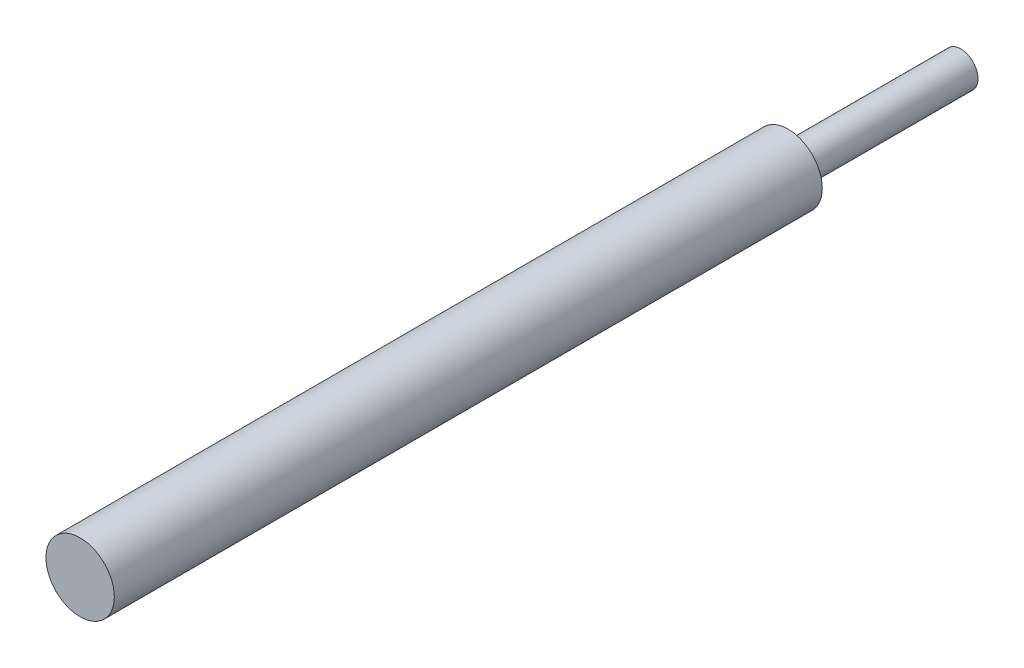
ISO-10303-21;
HEADER;
FILE_DESCRIPTION(('STEP AP214'),'2;1');
FILE_NAME('part.step','',(''),(''),'','','');
FILE_SCHEMA(('AUTOMOTIVE_DESIGN { 1 0 10303 214 1 1 1 1 }'));
ENDSEC;
DATA;
#1=APPLICATION_CONTEXT('core data for automotive mechanical design processes');
#2=APPLICATION_PROTOCOL_DEFINITION('international standard','automotive_design',2000,#1);
#3=PRODUCT_CONTEXT('',#1,'mechanical');
#4=PRODUCT('Part','Part','',(#3));
#5=PRODUCT_RELATED_PRODUCT_CATEGORY('part','',(#4));
#6=PRODUCT_DEFINITION_FORMATION('','',#4);
#7=PRODUCT_DEFINITION_CONTEXT('part definition',#1,'design');
#8=PRODUCT_DEFINITION('design','',#6,#7);
#9=PRODUCT_DEFINITION_SHAPE('','',#8);
#10=(LENGTH_UNIT() NAMED_UNIT(*) SI_UNIT(.MILLI.,.METRE.));
#11=(NAMED_UNIT(*) PLANE_ANGLE_UNIT() SI_UNIT($,.RADIAN.));
#12=(NAMED_UNIT(*) SI_UNIT($,.STERADIAN.) SOLID_ANGLE_UNIT());
#13=UNCERTAINTY_MEASURE_WITH_UNIT(LENGTH_MEASURE(1.E-05),#10,'distance_accuracy_value','');
#14=(GEOMETRIC_REPRESENTATION_CONTEXT(3) GLOBAL_UNCERTAINTY_ASSIGNED_CONTEXT((#13)) GLOBAL_UNIT_ASSIGNED_CONTEXT((#10,
#11,#12)) REPRESENTATION_CONTEXT('',''));
#15=CARTESIAN_POINT('',(0.,0.,0.));
#16=DIRECTION('',(0.,0.,1.));
#17=DIRECTION('',(1.,0.,0.));
#18=AXIS2_PLACEMENT_3D('',#15,#16,#17);
#19=CARTESIAN_POINT('',(0.,0.,-106.));
#20=DIRECTION('',(0.,0.,1.));
#21=DIRECTION('',(1.,0.,0.));
#22=AXIS2_PLACEMENT_3D('',#19,#20,#21);
#23=CYLINDRICAL_SURFACE('',#22,9.9);
#24=CARTESIAN_POINT('',(0.,0.,149.));
#25=DIRECTION('',(0.,0.,1.));
#26=DIRECTION('',(1.,0.,0.));
#27=AXIS2_PLACEMENT_3D('',#24,#25,#26);
#28=CIRCLE('',#27,9.9);
#29=CARTESIAN_POINT('',(9.9,0.,149.));
#30=VERTEX_POINT('',#29);
#31=EDGE_CURVE('E11',#30,#30,#28,.T.);
#32=ORIENTED_EDGE('',*,*,#31,.F.);
#33=EDGE_LOOP('',(#32));
#34=FACE_BOUND('',#33,.T.);
#35=CARTESIAN_POINT('',(0.,0.,-56.));
#36=DIRECTION('',(0.,0.,-1.));
#37=DIRECTION('',(-1.,0.,0.));
#38=AXIS2_PLACEMENT_3D('',#35,#36,#37);
#39=CIRCLE('',#38,9.9);
#40=CARTESIAN_POINT('',(-9.9,0.,-56.));
#41=VERTEX_POINT('',#40);
#42=EDGE_CURVE('E47',#41,#41,#39,.T.);
#43=ORIENTED_EDGE('',*,*,#42,.F.);
#44=EDGE_LOOP('',(#43));
#45=FACE_BOUND('',#44,.T.);
#46=ADVANCED_FACE('F41',(#34,#45),#23,.T.);
#47=CARTESIAN_POINT('',(0.,0.,149.));
#48=DIRECTION('',(0.,0.,1.));
#49=DIRECTION('',(1.,0.,0.));
#50=AXIS2_PLACEMENT_3D('',#47,#48,#49);
#51=PLANE('',#50);
#52=ORIENTED_EDGE('',*,*,#31,.T.);
#53=EDGE_LOOP('',(#52));
#54=FACE_BOUND('',#53,.T.);
#55=ADVANCED_FACE('F72',(#54),#51,.T.);
#56=CARTESIAN_POINT('',(0.,0.,-56.));
#57=DIRECTION('',(0.,0.,-1.));
#58=DIRECTION('',(-1.,0.,0.));
#59=AXIS2_PLACEMENT_3D('',#56,#57,#58);
#60=PLANE('',#59);
#61=CARTESIAN_POINT('',(0.,0.,-56.));
#62=DIRECTION('',(0.,0.,-1.));
#63=DIRECTION('',(-1.,0.,0.));
#64=AXIS2_PLACEMENT_3D('',#61,#62,#63);
#65=CIRCLE('',#64,5.);
#66=CARTESIAN_POINT('',(-5.,0.,-56.));
#67=VERTEX_POINT('',#66);
#68=EDGE_CURVE('E51',#67,#67,#65,.T.);
#69=ORIENTED_EDGE('',*,*,#68,.F.);
#70=EDGE_LOOP('',(#69));
#71=FACE_BOUND('',#70,.T.);
#72=ORIENTED_EDGE('',*,*,#42,.T.);
#73=EDGE_LOOP('',(#72));
#74=FACE_BOUND('',#73,.T.);
#75=ADVANCED_FACE('F65',(#71,#74),#60,.T.);
#76=CARTESIAN_POINT('',(0.,0.,-56.));
#77=DIRECTION('',(0.,0.,-1.));
#78=DIRECTION('',(-1.,0.,0.));
#79=AXIS2_PLACEMENT_3D('',#76,#77,#78);
#80=CYLINDRICAL_SURFACE('',#79,5.);
#81=ORIENTED_EDGE('',*,*,#68,.T.);
#82=EDGE_LOOP('',(#81));
#83=FACE_BOUND('',#82,.T.);
#84=CARTESIAN_POINT('',(0.,0.,-106.));
#85=DIRECTION('',(0.,0.,-1.));
#86=DIRECTION('',(-1.,0.,0.));
#87=AXIS2_PLACEMENT_3D('',#84,#85,#86);
#88=CIRCLE('',#87,5.);
#89=CARTESIAN_POINT('',(-5.,0.,-106.));
#90=VERTEX_POINT('',#89);
#91=EDGE_CURVE('E55',#90,#90,#88,.T.);
#92=ORIENTED_EDGE('',*,*,#91,.F.);
#93=EDGE_LOOP('',(#92));
#94=FACE_BOUND('',#93,.T.);
#95=ADVANCED_FACE('F63',(#83,#94),#80,.T.);
#96=CARTESIAN_POINT('',(0.,0.,-106.));
#97=DIRECTION('',(0.,0.,1.));
#98=DIRECTION('',(1.,0.,0.));
#99=AXIS2_PLACEMENT_3D('',#96,#97,#98);
#100=PLANE('',#99);
#101=ORIENTED_EDGE('',*,*,#91,.T.);
#102=EDGE_LOOP('',(#101));
#103=FACE_BOUND('',#102,.T.);
#104=ADVANCED_FACE('F61',(#103),#100,.F.);
#105=CLOSED_SHELL('',(#46,#55,#75,#95,#104));
#106=MANIFOLD_SOLID_BREP('B2',#105);
#107=ADVANCED_BREP_SHAPE_REPRESENTATION('',(#18,#106),#14);
#108=SHAPE_DEFINITION_REPRESENTATION(#9,#107);
ENDSEC;
END-ISO-10303-21;
